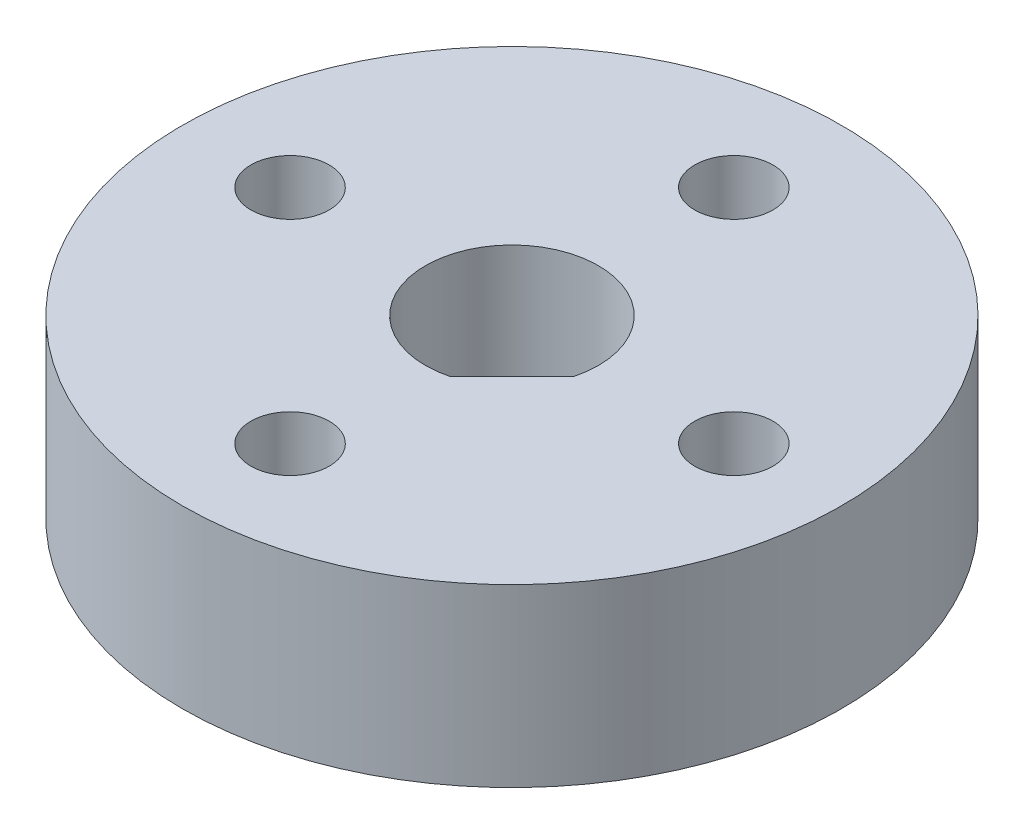
ISO-10303-21;
HEADER;
FILE_DESCRIPTION(('STEP AP214'),'2;1');
FILE_NAME('part.step','',(''),(''),'','','');
FILE_SCHEMA(('AUTOMOTIVE_DESIGN { 1 0 10303 214 1 1 1 1 }'));
ENDSEC;
DATA;
#1=APPLICATION_CONTEXT('core data for automotive mechanical design processes');
#2=APPLICATION_PROTOCOL_DEFINITION('international standard','automotive_design',2000,#1);
#3=PRODUCT_CONTEXT('',#1,'mechanical');
#4=PRODUCT('Part','Part','',(#3));
#5=PRODUCT_RELATED_PRODUCT_CATEGORY('part','',(#4));
#6=PRODUCT_DEFINITION_FORMATION('','',#4);
#7=PRODUCT_DEFINITION_CONTEXT('part definition',#1,'design');
#8=PRODUCT_DEFINITION('design','',#6,#7);
#9=PRODUCT_DEFINITION_SHAPE('','',#8);
#10=(LENGTH_UNIT() NAMED_UNIT(*) SI_UNIT(.MILLI.,.METRE.));
#11=(NAMED_UNIT(*) PLANE_ANGLE_UNIT() SI_UNIT($,.RADIAN.));
#12=(NAMED_UNIT(*) SI_UNIT($,.STERADIAN.) SOLID_ANGLE_UNIT());
#13=UNCERTAINTY_MEASURE_WITH_UNIT(LENGTH_MEASURE(1.E-05),#10,'distance_accuracy_value','');
#14=(GEOMETRIC_REPRESENTATION_CONTEXT(3) GLOBAL_UNCERTAINTY_ASSIGNED_CONTEXT((#13)) GLOBAL_UNIT_ASSIGNED_CONTEXT((#10,
#11,#12)) REPRESENTATION_CONTEXT('',''));
#15=CARTESIAN_POINT('',(0.,0.,0.));
#16=DIRECTION('',(0.,0.,1.));
#17=DIRECTION('',(1.,0.,0.));
#18=AXIS2_PLACEMENT_3D('',#15,#16,#17);
#19=CARTESIAN_POINT('',(0.,5.08,0.));
#20=DIRECTION('',(0.,1.,0.));
#21=DIRECTION('',(0.,0.,1.));
#22=AXIS2_PLACEMENT_3D('',#19,#20,#21);
#23=PLANE('',#22);
#24=CARTESIAN_POINT('',(-6.41307264640976,5.08,0.));
#25=DIRECTION('',(0.,1.,0.));
#26=DIRECTION('',(0.,0.,1.));
#27=AXIS2_PLACEMENT_3D('',#24,#25,#26);
#28=CIRCLE('',#27,1.13029999999999);
#29=CARTESIAN_POINT('',(-6.41307264640976,5.08,1.13029999999992));
#30=VERTEX_POINT('',#29);
#31=EDGE_CURVE('E98',#30,#30,#28,.T.);
#32=ORIENTED_EDGE('',*,*,#31,.F.);
#33=EDGE_LOOP('',(#32));
#34=FACE_BOUND('',#33,.T.);
#35=CARTESIAN_POINT('',(0.,5.08,6.41307264640976));
#36=DIRECTION('',(0.,1.,0.));
#37=DIRECTION('',(0.,0.,1.));
#38=AXIS2_PLACEMENT_3D('',#35,#36,#37);
#39=CIRCLE('',#38,1.13029999999999);
#40=CARTESIAN_POINT('',(0.,5.08,7.54337264640975));
#41=VERTEX_POINT('',#40);
#42=EDGE_CURVE('E92',#41,#41,#39,.T.);
#43=ORIENTED_EDGE('',*,*,#42,.F.);
#44=EDGE_LOOP('',(#43));
#45=FACE_BOUND('',#44,.T.);
#46=CARTESIAN_POINT('',(6.41307264640976,5.08,0.));
#47=DIRECTION('',(0.,1.,0.));
#48=DIRECTION('',(0.,0.,1.));
#49=AXIS2_PLACEMENT_3D('',#46,#47,#48);
#50=CIRCLE('',#49,1.13029999999999);
#51=CARTESIAN_POINT('',(6.41307264640976,5.08,1.13030000000001));
#52=VERTEX_POINT('',#51);
#53=EDGE_CURVE('E86',#52,#52,#50,.T.);
#54=ORIENTED_EDGE('',*,*,#53,.F.);
#55=EDGE_LOOP('',(#54));
#56=FACE_BOUND('',#55,.T.);
#57=CARTESIAN_POINT('',(0.,5.08,-6.41307264640976));
#58=DIRECTION('',(0.,1.,0.));
#59=DIRECTION('',(0.,0.,1.));
#60=AXIS2_PLACEMENT_3D('',#57,#58,#59);
#61=CIRCLE('',#60,1.13029999999999);
#62=CARTESIAN_POINT('',(0.,5.08,-5.28277264640978));
#63=VERTEX_POINT('',#62);
#64=EDGE_CURVE('E74',#63,#63,#61,.T.);
#65=ORIENTED_EDGE('',*,*,#64,.F.);
#66=EDGE_LOOP('',(#65));
#67=FACE_BOUND('',#66,.T.);
#68=CARTESIAN_POINT('',(0.,5.08,0.));
#69=DIRECTION('',(0.,1.,0.));
#70=DIRECTION('',(0.,0.,1.));
#71=AXIS2_PLACEMENT_3D('',#68,#69,#70);
#72=CIRCLE('',#71,9.525);
#73=CARTESIAN_POINT('',(0.,5.08,9.525));
#74=VERTEX_POINT('',#73);
#75=EDGE_CURVE('E11',#74,#74,#72,.T.);
#76=ORIENTED_EDGE('',*,*,#75,.T.);
#77=EDGE_LOOP('',(#76));
#78=FACE_BOUND('',#77,.T.);
#79=DIRECTION('',(0.707106781186546,0.,-0.707106781186549));
#80=VECTOR('',#79,1.);
#81=CARTESIAN_POINT('',(0.62465294885072,5.08,2.42070417306454));
#82=LINE('',#81,#80);
#83=CARTESIAN_POINT('',(0.62465294885072,5.08,2.42070417306454));
#84=VERTEX_POINT('',#83);
#85=CARTESIAN_POINT('',(2.42070417306455,5.08,0.62465294885071));
#86=VERTEX_POINT('',#85);
#87=EDGE_CURVE('E77',#84,#86,#82,.T.);
#88=ORIENTED_EDGE('',*,*,#87,.F.);
#89=CARTESIAN_POINT('',(0.,5.08,0.));
#90=DIRECTION('',(0.,1.,0.));
#91=DIRECTION('',(0.,0.,1.));
#92=AXIS2_PLACEMENT_3D('',#89,#90,#91);
#93=CIRCLE('',#92,2.5);
#94=EDGE_CURVE('E64',#86,#84,#93,.T.);
#95=ORIENTED_EDGE('',*,*,#94,.F.);
#96=EDGE_LOOP('',(#88,#95));
#97=FACE_BOUND('',#96,.T.);
#98=ADVANCED_FACE('F32',(#34,#45,#56,#67,#78,#97),#23,.T.);
#99=CARTESIAN_POINT('',(0.,0.,0.));
#100=DIRECTION('',(0.,1.,0.));
#101=DIRECTION('',(0.,0.,1.));
#102=AXIS2_PLACEMENT_3D('',#99,#100,#101);
#103=PLANE('',#102);
#104=CARTESIAN_POINT('',(-6.41307264640976,0.,0.));
#105=DIRECTION('',(0.,1.,0.));
#106=DIRECTION('',(0.,0.,1.));
#107=AXIS2_PLACEMENT_3D('',#104,#105,#106);
#108=CIRCLE('',#107,1.13029999999999);
#109=CARTESIAN_POINT('',(-6.41307264640976,0.,1.13029999999992));
#110=VERTEX_POINT('',#109);
#111=EDGE_CURVE('E95',#110,#110,#108,.T.);
#112=ORIENTED_EDGE('',*,*,#111,.T.);
#113=EDGE_LOOP('',(#112));
#114=FACE_BOUND('',#113,.T.);
#115=CARTESIAN_POINT('',(0.,0.,6.41307264640976));
#116=DIRECTION('',(0.,1.,0.));
#117=DIRECTION('',(0.,0.,1.));
#118=AXIS2_PLACEMENT_3D('',#115,#116,#117);
#119=CIRCLE('',#118,1.13029999999999);
#120=CARTESIAN_POINT('',(0.,0.,7.54337264640975));
#121=VERTEX_POINT('',#120);
#122=EDGE_CURVE('E89',#121,#121,#119,.T.);
#123=ORIENTED_EDGE('',*,*,#122,.T.);
#124=EDGE_LOOP('',(#123));
#125=FACE_BOUND('',#124,.T.);
#126=CARTESIAN_POINT('',(6.41307264640976,0.,0.));
#127=DIRECTION('',(0.,1.,0.));
#128=DIRECTION('',(0.,0.,1.));
#129=AXIS2_PLACEMENT_3D('',#126,#127,#128);
#130=CIRCLE('',#129,1.13029999999999);
#131=CARTESIAN_POINT('',(6.41307264640976,0.,1.13030000000001));
#132=VERTEX_POINT('',#131);
#133=EDGE_CURVE('E83',#132,#132,#130,.T.);
#134=ORIENTED_EDGE('',*,*,#133,.T.);
#135=EDGE_LOOP('',(#134));
#136=FACE_BOUND('',#135,.T.);
#137=CARTESIAN_POINT('',(0.,0.,-6.41307264640976));
#138=DIRECTION('',(0.,1.,0.));
#139=DIRECTION('',(0.,0.,1.));
#140=AXIS2_PLACEMENT_3D('',#137,#138,#139);
#141=CIRCLE('',#140,1.13029999999999);
#142=CARTESIAN_POINT('',(0.,0.,-5.28277264640978));
#143=VERTEX_POINT('',#142);
#144=EDGE_CURVE('E71',#143,#143,#141,.T.);
#145=ORIENTED_EDGE('',*,*,#144,.T.);
#146=EDGE_LOOP('',(#145));
#147=FACE_BOUND('',#146,.T.);
#148=CARTESIAN_POINT('',(0.,0.,0.));
#149=DIRECTION('',(0.,1.,0.));
#150=DIRECTION('',(0.,0.,1.));
#151=AXIS2_PLACEMENT_3D('',#148,#149,#150);
#152=CIRCLE('',#151,9.525);
#153=CARTESIAN_POINT('',(0.,0.,9.525));
#154=VERTEX_POINT('',#153);
#155=EDGE_CURVE('E36',#154,#154,#152,.T.);
#156=ORIENTED_EDGE('',*,*,#155,.F.);
#157=EDGE_LOOP('',(#156));
#158=FACE_BOUND('',#157,.T.);
#159=CARTESIAN_POINT('',(0.,0.,0.));
#160=DIRECTION('',(0.,1.,0.));
#161=DIRECTION('',(0.,0.,1.));
#162=AXIS2_PLACEMENT_3D('',#159,#160,#161);
#163=CIRCLE('',#162,2.5);
#164=CARTESIAN_POINT('',(2.42070417306455,0.,0.62465294885071));
#165=VERTEX_POINT('',#164);
#166=CARTESIAN_POINT('',(0.62465294885072,0.,2.42070417306454));
#167=VERTEX_POINT('',#166);
#168=EDGE_CURVE('E54',#165,#167,#163,.T.);
#169=ORIENTED_EDGE('',*,*,#168,.T.);
#170=DIRECTION('',(0.707106781186546,0.,-0.707106781186549));
#171=VECTOR('',#170,1.);
#172=CARTESIAN_POINT('',(0.62465294885072,0.,2.42070417306454));
#173=LINE('',#172,#171);
#174=EDGE_CURVE('E60',#167,#165,#173,.T.);
#175=ORIENTED_EDGE('',*,*,#174,.T.);
#176=EDGE_LOOP('',(#169,#175));
#177=FACE_BOUND('',#176,.T.);
#178=ADVANCED_FACE('F70',(#114,#125,#136,#147,#158,#177),#103,.F.);
#179=CARTESIAN_POINT('',(0.,5.08,0.));
#180=DIRECTION('',(0.,-1.,0.));
#181=DIRECTION('',(0.,0.,-1.));
#182=AXIS2_PLACEMENT_3D('',#179,#180,#181);
#183=CYLINDRICAL_SURFACE('',#182,9.525);
#184=ORIENTED_EDGE('',*,*,#75,.F.);
#185=EDGE_LOOP('',(#184));
#186=FACE_BOUND('',#185,.T.);
#187=ORIENTED_EDGE('',*,*,#155,.T.);
#188=EDGE_LOOP('',(#187));
#189=FACE_BOUND('',#188,.T.);
#190=ADVANCED_FACE('F34',(#186,#189),#183,.T.);
#191=CARTESIAN_POINT('',(0.,5.08,0.));
#192=DIRECTION('',(0.,-1.,0.));
#193=DIRECTION('',(0.,0.,-1.));
#194=AXIS2_PLACEMENT_3D('',#191,#192,#193);
#195=CYLINDRICAL_SURFACE('',#194,2.5);
#196=ORIENTED_EDGE('',*,*,#168,.F.);
#197=DIRECTION('',(0.,-1.,0.));
#198=VECTOR('',#197,1.);
#199=CARTESIAN_POINT('',(2.42070417306455,5.08,0.62465294885071));
#200=LINE('',#199,#198);
#201=EDGE_CURVE('E62',#86,#165,#200,.T.);
#202=ORIENTED_EDGE('',*,*,#201,.F.);
#203=ORIENTED_EDGE('',*,*,#94,.T.);
#204=DIRECTION('',(0.,-1.,0.));
#205=VECTOR('',#204,1.);
#206=CARTESIAN_POINT('',(0.62465294885072,5.08,2.42070417306454));
#207=LINE('',#206,#205);
#208=EDGE_CURVE('E47',#84,#167,#207,.T.);
#209=ORIENTED_EDGE('',*,*,#208,.T.);
#210=EDGE_LOOP('',(#196,#202,#203,#209));
#211=FACE_BOUND('',#210,.T.);
#212=ADVANCED_FACE('F66',(#211),#195,.F.);
#213=CARTESIAN_POINT('',(0.62465294885072,5.08,2.42070417306454));
#214=DIRECTION('',(-0.707106781186549,0.,-0.707106781186546));
#215=DIRECTION('',(-0.707106781186546,0.,0.707106781186549));
#216=AXIS2_PLACEMENT_3D('',#213,#214,#215);
#217=PLANE('',#216);
#218=ORIENTED_EDGE('',*,*,#174,.F.);
#219=ORIENTED_EDGE('',*,*,#208,.F.);
#220=ORIENTED_EDGE('',*,*,#87,.T.);
#221=ORIENTED_EDGE('',*,*,#201,.T.);
#222=EDGE_LOOP('',(#218,#219,#220,#221));
#223=FACE_BOUND('',#222,.T.);
#224=ADVANCED_FACE('F61',(#223),#217,.T.);
#225=CARTESIAN_POINT('',(0.,5.08,-6.41307264640976));
#226=DIRECTION('',(0.,1.,0.));
#227=DIRECTION('',(0.,0.,1.));
#228=AXIS2_PLACEMENT_3D('',#225,#226,#227);
#229=CYLINDRICAL_SURFACE('',#228,1.13029999999999);
#230=ORIENTED_EDGE('',*,*,#144,.F.);
#231=EDGE_LOOP('',(#230));
#232=FACE_BOUND('',#231,.T.);
#233=ORIENTED_EDGE('',*,*,#64,.T.);
#234=EDGE_LOOP('',(#233));
#235=FACE_BOUND('',#234,.T.);
#236=ADVANCED_FACE('F131',(#232,#235),#229,.F.);
#237=CARTESIAN_POINT('',(6.41307264640976,5.08,0.));
#238=DIRECTION('',(0.,1.,0.));
#239=DIRECTION('',(0.,0.,1.));
#240=AXIS2_PLACEMENT_3D('',#237,#238,#239);
#241=CYLINDRICAL_SURFACE('',#240,1.13029999999999);
#242=ORIENTED_EDGE('',*,*,#133,.F.);
#243=EDGE_LOOP('',(#242));
#244=FACE_BOUND('',#243,.T.);
#245=ORIENTED_EDGE('',*,*,#53,.T.);
#246=EDGE_LOOP('',(#245));
#247=FACE_BOUND('',#246,.T.);
#248=ADVANCED_FACE('F134',(#244,#247),#241,.F.);
#249=CARTESIAN_POINT('',(0.,5.08,6.41307264640976));
#250=DIRECTION('',(0.,1.,0.));
#251=DIRECTION('',(0.,0.,1.));
#252=AXIS2_PLACEMENT_3D('',#249,#250,#251);
#253=CYLINDRICAL_SURFACE('',#252,1.13029999999999);
#254=ORIENTED_EDGE('',*,*,#122,.F.);
#255=EDGE_LOOP('',(#254));
#256=FACE_BOUND('',#255,.T.);
#257=ORIENTED_EDGE('',*,*,#42,.T.);
#258=EDGE_LOOP('',(#257));
#259=FACE_BOUND('',#258,.T.);
#260=ADVANCED_FACE('F138',(#256,#259),#253,.F.);
#261=CARTESIAN_POINT('',(-6.41307264640976,5.08,0.));
#262=DIRECTION('',(0.,1.,0.));
#263=DIRECTION('',(0.,0.,1.));
#264=AXIS2_PLACEMENT_3D('',#261,#262,#263);
#265=CYLINDRICAL_SURFACE('',#264,1.13029999999999);
#266=ORIENTED_EDGE('',*,*,#111,.F.);
#267=EDGE_LOOP('',(#266));
#268=FACE_BOUND('',#267,.T.);
#269=ORIENTED_EDGE('',*,*,#31,.T.);
#270=EDGE_LOOP('',(#269));
#271=FACE_BOUND('',#270,.T.);
#272=ADVANCED_FACE('F102',(#268,#271),#265,.F.);
#273=CLOSED_SHELL('',(#98,#178,#190,#212,#224,#236,#248,#260,#272));
#274=MANIFOLD_SOLID_BREP('B2',#273);
#275=ADVANCED_BREP_SHAPE_REPRESENTATION('',(#18,#274),#14);
#276=SHAPE_DEFINITION_REPRESENTATION(#9,#275);
ENDSEC;
END-ISO-10303-21;
